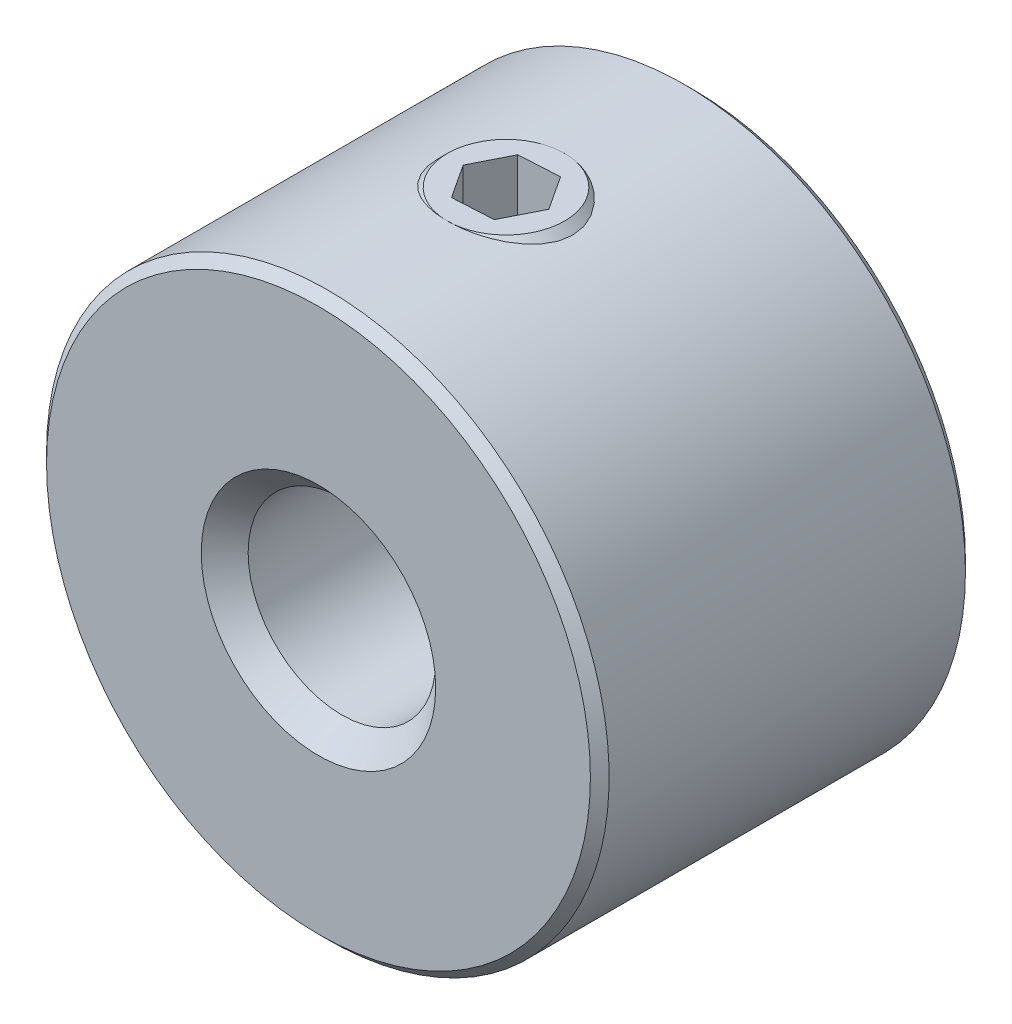
ISO-10303-21;
HEADER;
FILE_DESCRIPTION(('STEP AP214'),'2;1');
FILE_NAME('part.step','',(''),(''),'','','');
FILE_SCHEMA(('AUTOMOTIVE_DESIGN { 1 0 10303 214 1 1 1 1 }'));
ENDSEC;
DATA;
#1=APPLICATION_CONTEXT('core data for automotive mechanical design processes');
#2=APPLICATION_PROTOCOL_DEFINITION('international standard','automotive_design',2000,#1);
#3=PRODUCT_CONTEXT('',#1,'mechanical');
#4=PRODUCT('Part','Part','',(#3));
#5=PRODUCT_RELATED_PRODUCT_CATEGORY('part','',(#4));
#6=PRODUCT_DEFINITION_FORMATION('','',#4);
#7=PRODUCT_DEFINITION_CONTEXT('part definition',#1,'design');
#8=PRODUCT_DEFINITION('design','',#6,#7);
#9=PRODUCT_DEFINITION_SHAPE('','',#8);
#10=(LENGTH_UNIT() NAMED_UNIT(*) SI_UNIT(.MILLI.,.METRE.));
#11=(NAMED_UNIT(*) PLANE_ANGLE_UNIT() SI_UNIT($,.RADIAN.));
#12=(NAMED_UNIT(*) SI_UNIT($,.STERADIAN.) SOLID_ANGLE_UNIT());
#13=UNCERTAINTY_MEASURE_WITH_UNIT(LENGTH_MEASURE(1.E-05),#10,'distance_accuracy_value','');
#14=(GEOMETRIC_REPRESENTATION_CONTEXT(3) GLOBAL_UNCERTAINTY_ASSIGNED_CONTEXT((#13)) GLOBAL_UNIT_ASSIGNED_CONTEXT((#10,
#11,#12)) REPRESENTATION_CONTEXT('',''));
#15=CARTESIAN_POINT('',(0.,0.,0.));
#16=DIRECTION('',(0.,0.,1.));
#17=DIRECTION('',(1.,0.,0.));
#18=AXIS2_PLACEMENT_3D('',#15,#16,#17);
#19=CARTESIAN_POINT('',(0.,6.,4.00000000000001));
#20=DIRECTION('',(0.,-1.,0.));
#21=DIRECTION('',(0.,0.,-1.));
#22=AXIS2_PLACEMENT_3D('',#19,#20,#21);
#23=CYLINDRICAL_SURFACE('',#22,1.5);
#24=CARTESIAN_POINT('',(0.,5.75,4.00000000000001));
#25=DIRECTION('',(0.,1.,0.));
#26=DIRECTION('',(0.,0.,1.));
#27=AXIS2_PLACEMENT_3D('',#24,#25,#26);
#28=CIRCLE('',#27,1.5);
#29=CARTESIAN_POINT('',(0.,5.75,5.50000000000001));
#30=VERTEX_POINT('',#29);
#31=EDGE_CURVE('E12',#30,#30,#28,.F.);
#32=ORIENTED_EDGE('',*,*,#31,.T.);
#33=EDGE_LOOP('',(#32));
#34=FACE_BOUND('',#33,.T.);
#35=CARTESIAN_POINT('',(0.,1.5,4.00000000000001));
#36=DIRECTION('',(0.,1.,0.));
#37=DIRECTION('',(0.,0.,1.));
#38=AXIS2_PLACEMENT_3D('',#35,#36,#37);
#39=CIRCLE('',#38,1.5);
#40=CARTESIAN_POINT('',(0.,1.5,5.50000000000001));
#41=VERTEX_POINT('',#40);
#42=EDGE_CURVE('E146',#41,#41,#39,.T.);
#43=ORIENTED_EDGE('',*,*,#42,.T.);
#44=EDGE_LOOP('',(#43));
#45=FACE_BOUND('',#44,.T.);
#46=ADVANCED_FACE('F44',(#34,#45),#23,.T.);
#47=CARTESIAN_POINT('',(0.,6.,4.00000000000001));
#48=DIRECTION('',(0.,1.,0.));
#49=DIRECTION('',(0.,0.,1.));
#50=AXIS2_PLACEMENT_3D('',#47,#48,#49);
#51=PLANE('',#50);
#52=DIRECTION('',(0.998413648366382,0.,-0.0563044115121643));
#53=VECTOR('',#52,1.);
#54=CARTESIAN_POINT('',(-0.390097482851071,6.,4.77319076163213));
#55=LINE('',#54,#53);
#56=CARTESIAN_POINT('',(-0.390097482851071,6.,4.77319076163213));
#57=VERTEX_POINT('',#56);
#58=CARTESIAN_POINT('',(0.47455410011932,6.,4.72442971091746));
#59=VERTEX_POINT('',#58);
#60=EDGE_CURVE('E59',#57,#59,#55,.T.);
#61=ORIENTED_EDGE('',*,*,#60,.F.);
#62=DIRECTION('',(0.547967874897857,0.,0.836499377214309));
#63=VECTOR('',#62,1.);
#64=CARTESIAN_POINT('',(-0.864651582970388,6.,4.04876105071467));
#65=LINE('',#64,#63);
#66=CARTESIAN_POINT('',(-0.864651582970388,6.,4.04876105071467));
#67=VERTEX_POINT('',#66);
#68=EDGE_CURVE('E142',#67,#57,#65,.T.);
#69=ORIENTED_EDGE('',*,*,#68,.F.);
#70=DIRECTION('',(-0.450445773468524,0.,0.892803788726472));
#71=VECTOR('',#70,1.);
#72=CARTESIAN_POINT('',(-0.474554100119317,6.,3.27557028908255));
#73=LINE('',#72,#71);
#74=CARTESIAN_POINT('',(-0.474554100119317,6.,3.27557028908255));
#75=VERTEX_POINT('',#74);
#76=EDGE_CURVE('E140',#75,#67,#73,.T.);
#77=ORIENTED_EDGE('',*,*,#76,.F.);
#78=DIRECTION('',(-0.998413648366382,0.,0.0563044115121643));
#79=VECTOR('',#78,1.);
#80=CARTESIAN_POINT('',(0.390097482851073,6.,3.22680923836789));
#81=LINE('',#80,#79);
#82=CARTESIAN_POINT('',(0.390097482851073,6.,3.22680923836789));
#83=VERTEX_POINT('',#82);
#84=EDGE_CURVE('E107',#83,#75,#81,.T.);
#85=ORIENTED_EDGE('',*,*,#84,.F.);
#86=DIRECTION('',(-0.547967874897857,0.,-0.836499377214308));
#87=VECTOR('',#86,1.);
#88=CARTESIAN_POINT('',(0.864651582970391,6.,3.95123894928534));
#89=LINE('',#88,#87);
#90=CARTESIAN_POINT('',(0.864651582970391,6.,3.95123894928534));
#91=VERTEX_POINT('',#90);
#92=EDGE_CURVE('E136',#91,#83,#89,.T.);
#93=ORIENTED_EDGE('',*,*,#92,.F.);
#94=DIRECTION('',(0.450445773468524,0.,-0.892803788726472));
#95=VECTOR('',#94,1.);
#96=CARTESIAN_POINT('',(0.474554100119319,6.,4.72442971091746));
#97=LINE('',#96,#95);
#98=EDGE_CURVE('E133',#59,#91,#97,.T.);
#99=ORIENTED_EDGE('',*,*,#98,.F.);
#100=EDGE_LOOP('',(#61,#69,#77,#85,#93,#99));
#101=FACE_BOUND('',#100,.T.);
#102=CARTESIAN_POINT('',(0.,6.,4.00000000000001));
#103=DIRECTION('',(0.,1.,0.));
#104=DIRECTION('',(0.,0.,1.));
#105=AXIS2_PLACEMENT_3D('',#102,#103,#104);
#106=CIRCLE('',#105,1.25);
#107=CARTESIAN_POINT('',(0.,6.,5.25000000000001));
#108=VERTEX_POINT('',#107);
#109=EDGE_CURVE('E52',#108,#108,#106,.T.);
#110=ORIENTED_EDGE('',*,*,#109,.T.);
#111=EDGE_LOOP('',(#110));
#112=FACE_BOUND('',#111,.T.);
#113=ADVANCED_FACE('F156',(#101,#112),#51,.T.);
#114=CARTESIAN_POINT('',(0.,1.5,4.00000000000001));
#115=DIRECTION('',(0.,1.,0.));
#116=DIRECTION('',(0.,0.,1.));
#117=AXIS2_PLACEMENT_3D('',#114,#115,#116);
#118=PLANE('',#117);
#119=ORIENTED_EDGE('',*,*,#42,.F.);
#120=EDGE_LOOP('',(#119));
#121=FACE_BOUND('',#120,.T.);
#122=ADVANCED_FACE('F160',(#121),#118,.F.);
#123=CARTESIAN_POINT('',(0.,6.,4.00000000000001));
#124=DIRECTION('',(0.,-1.,0.));
#125=DIRECTION('',(0.,0.,-1.));
#126=AXIS2_PLACEMENT_3D('',#123,#124,#125);
#127=CONICAL_SURFACE('',#126,1.25,0.785398163397446);
#128=ORIENTED_EDGE('',*,*,#31,.F.);
#129=EDGE_LOOP('',(#128));
#130=FACE_BOUND('',#129,.T.);
#131=ORIENTED_EDGE('',*,*,#109,.F.);
#132=EDGE_LOOP('',(#131));
#133=FACE_BOUND('',#132,.T.);
#134=ADVANCED_FACE('F46',(#130,#133),#127,.T.);
#135=CARTESIAN_POINT('',(-0.390097482851071,4.,4.77319076163213));
#136=DIRECTION('',(0.0563044115121643,0.,0.998413648366382));
#137=DIRECTION('',(0.998413648366382,0.,-0.0563044115121643));
#138=AXIS2_PLACEMENT_3D('',#135,#136,#137);
#139=PLANE('',#138);
#140=ORIENTED_EDGE('',*,*,#60,.T.);
#141=DIRECTION('',(0.,1.,0.));
#142=VECTOR('',#141,1.);
#143=CARTESIAN_POINT('',(0.474554100119319,4.,4.72442971091746));
#144=LINE('',#143,#142);
#145=CARTESIAN_POINT('',(0.474554100119319,4.,4.72442971091746));
#146=VERTEX_POINT('',#145);
#147=EDGE_CURVE('E89',#146,#59,#144,.T.);
#148=ORIENTED_EDGE('',*,*,#147,.F.);
#149=DIRECTION('',(0.998413648366382,0.,-0.0563044115121643));
#150=VECTOR('',#149,1.);
#151=CARTESIAN_POINT('',(-0.390097482851071,4.,4.77319076163213));
#152=LINE('',#151,#150);
#153=CARTESIAN_POINT('',(-0.390097482851071,4.,4.77319076163213));
#154=VERTEX_POINT('',#153);
#155=EDGE_CURVE('E144',#154,#146,#152,.T.);
#156=ORIENTED_EDGE('',*,*,#155,.F.);
#157=DIRECTION('',(0.,1.,0.));
#158=VECTOR('',#157,1.);
#159=CARTESIAN_POINT('',(-0.390097482851071,4.,4.77319076163213));
#160=LINE('',#159,#158);
#161=EDGE_CURVE('E67',#154,#57,#160,.T.);
#162=ORIENTED_EDGE('',*,*,#161,.T.);
#163=EDGE_LOOP('',(#140,#148,#156,#162));
#164=FACE_BOUND('',#163,.T.);
#165=ADVANCED_FACE('F159',(#164),#139,.F.);
#166=CARTESIAN_POINT('',(-0.864651582970388,4.,4.04876105071467));
#167=DIRECTION('',(-0.836499377214309,0.,0.547967874897857));
#168=DIRECTION('',(0.547967874897857,0.,0.836499377214309));
#169=AXIS2_PLACEMENT_3D('',#166,#167,#168);
#170=PLANE('',#169);
#171=ORIENTED_EDGE('',*,*,#68,.T.);
#172=ORIENTED_EDGE('',*,*,#161,.F.);
#173=DIRECTION('',(0.547967874897857,0.,0.836499377214309));
#174=VECTOR('',#173,1.);
#175=CARTESIAN_POINT('',(-0.864651582970388,4.,4.04876105071467));
#176=LINE('',#175,#174);
#177=CARTESIAN_POINT('',(-0.864651582970388,4.,4.04876105071467));
#178=VERTEX_POINT('',#177);
#179=EDGE_CURVE('E119',#178,#154,#176,.T.);
#180=ORIENTED_EDGE('',*,*,#179,.F.);
#181=DIRECTION('',(0.,1.,0.));
#182=VECTOR('',#181,1.);
#183=CARTESIAN_POINT('',(-0.864651582970388,4.,4.04876105071467));
#184=LINE('',#183,#182);
#185=EDGE_CURVE('E111',#178,#67,#184,.T.);
#186=ORIENTED_EDGE('',*,*,#185,.T.);
#187=EDGE_LOOP('',(#171,#172,#180,#186));
#188=FACE_BOUND('',#187,.T.);
#189=ADVANCED_FACE('F166',(#188),#170,.F.);
#190=CARTESIAN_POINT('',(-0.474554100119317,4.,3.27557028908255));
#191=DIRECTION('',(-0.892803788726472,0.,-0.450445773468524));
#192=DIRECTION('',(-0.450445773468524,0.,0.892803788726472));
#193=AXIS2_PLACEMENT_3D('',#190,#191,#192);
#194=PLANE('',#193);
#195=ORIENTED_EDGE('',*,*,#76,.T.);
#196=ORIENTED_EDGE('',*,*,#185,.F.);
#197=DIRECTION('',(-0.450445773468524,0.,0.892803788726472));
#198=VECTOR('',#197,1.);
#199=CARTESIAN_POINT('',(-0.474554100119317,4.,3.27557028908255));
#200=LINE('',#199,#198);
#201=CARTESIAN_POINT('',(-0.474554100119317,4.,3.27557028908255));
#202=VERTEX_POINT('',#201);
#203=EDGE_CURVE('E115',#202,#178,#200,.T.);
#204=ORIENTED_EDGE('',*,*,#203,.F.);
#205=DIRECTION('',(0.,1.,0.));
#206=VECTOR('',#205,1.);
#207=CARTESIAN_POINT('',(-0.474554100119317,4.,3.27557028908255));
#208=LINE('',#207,#206);
#209=EDGE_CURVE('E100',#202,#75,#208,.T.);
#210=ORIENTED_EDGE('',*,*,#209,.T.);
#211=EDGE_LOOP('',(#195,#196,#204,#210));
#212=FACE_BOUND('',#211,.T.);
#213=ADVANCED_FACE('F116',(#212),#194,.F.);
#214=CARTESIAN_POINT('',(0.390097482851073,4.,3.22680923836789));
#215=DIRECTION('',(-0.0563044115121643,0.,-0.998413648366382));
#216=DIRECTION('',(-0.998413648366382,0.,0.0563044115121643));
#217=AXIS2_PLACEMENT_3D('',#214,#215,#216);
#218=PLANE('',#217);
#219=ORIENTED_EDGE('',*,*,#84,.T.);
#220=ORIENTED_EDGE('',*,*,#209,.F.);
#221=DIRECTION('',(-0.998413648366382,0.,0.0563044115121643));
#222=VECTOR('',#221,1.);
#223=CARTESIAN_POINT('',(0.390097482851073,4.,3.22680923836789));
#224=LINE('',#223,#222);
#225=CARTESIAN_POINT('',(0.390097482851073,4.,3.22680923836789));
#226=VERTEX_POINT('',#225);
#227=EDGE_CURVE('E104',#226,#202,#224,.T.);
#228=ORIENTED_EDGE('',*,*,#227,.F.);
#229=DIRECTION('',(0.,1.,0.));
#230=VECTOR('',#229,1.);
#231=CARTESIAN_POINT('',(0.390097482851073,4.,3.22680923836789));
#232=LINE('',#231,#230);
#233=EDGE_CURVE('E112',#226,#83,#232,.T.);
#234=ORIENTED_EDGE('',*,*,#233,.T.);
#235=EDGE_LOOP('',(#219,#220,#228,#234));
#236=FACE_BOUND('',#235,.T.);
#237=ADVANCED_FACE('F102',(#236),#218,.F.);
#238=CARTESIAN_POINT('',(0.864651582970391,4.,3.95123894928534));
#239=DIRECTION('',(0.836499377214308,0.,-0.547967874897857));
#240=DIRECTION('',(-0.547967874897857,0.,-0.836499377214309));
#241=AXIS2_PLACEMENT_3D('',#238,#239,#240);
#242=PLANE('',#241);
#243=ORIENTED_EDGE('',*,*,#92,.T.);
#244=ORIENTED_EDGE('',*,*,#233,.F.);
#245=DIRECTION('',(-0.547967874897857,0.,-0.836499377214308));
#246=VECTOR('',#245,1.);
#247=CARTESIAN_POINT('',(0.864651582970391,4.,3.95123894928534));
#248=LINE('',#247,#246);
#249=CARTESIAN_POINT('',(0.864651582970391,4.,3.95123894928534));
#250=VERTEX_POINT('',#249);
#251=EDGE_CURVE('E125',#250,#226,#248,.T.);
#252=ORIENTED_EDGE('',*,*,#251,.F.);
#253=DIRECTION('',(0.,1.,0.));
#254=VECTOR('',#253,1.);
#255=CARTESIAN_POINT('',(0.864651582970391,4.,3.95123894928534));
#256=LINE('',#255,#254);
#257=EDGE_CURVE('E149',#250,#91,#256,.T.);
#258=ORIENTED_EDGE('',*,*,#257,.T.);
#259=EDGE_LOOP('',(#243,#244,#252,#258));
#260=FACE_BOUND('',#259,.T.);
#261=ADVANCED_FACE('F183',(#260),#242,.F.);
#262=CARTESIAN_POINT('',(0.474554100119319,4.,4.72442971091746));
#263=DIRECTION('',(0.892803788726472,0.,0.450445773468524));
#264=DIRECTION('',(0.450445773468524,0.,-0.892803788726472));
#265=AXIS2_PLACEMENT_3D('',#262,#263,#264);
#266=PLANE('',#265);
#267=ORIENTED_EDGE('',*,*,#98,.T.);
#268=ORIENTED_EDGE('',*,*,#257,.F.);
#269=DIRECTION('',(0.450445773468524,0.,-0.892803788726472));
#270=VECTOR('',#269,1.);
#271=CARTESIAN_POINT('',(0.474554100119319,4.,4.72442971091746));
#272=LINE('',#271,#270);
#273=EDGE_CURVE('E127',#146,#250,#272,.T.);
#274=ORIENTED_EDGE('',*,*,#273,.F.);
#275=ORIENTED_EDGE('',*,*,#147,.T.);
#276=EDGE_LOOP('',(#267,#268,#274,#275));
#277=FACE_BOUND('',#276,.T.);
#278=ADVANCED_FACE('F180',(#277),#266,.F.);
#279=CARTESIAN_POINT('',(0.,4.,0.));
#280=DIRECTION('',(0.,1.,0.));
#281=DIRECTION('',(0.,0.,1.));
#282=AXIS2_PLACEMENT_3D('',#279,#280,#281);
#283=PLANE('',#282);
#284=ORIENTED_EDGE('',*,*,#155,.T.);
#285=ORIENTED_EDGE('',*,*,#273,.T.);
#286=ORIENTED_EDGE('',*,*,#251,.T.);
#287=ORIENTED_EDGE('',*,*,#227,.T.);
#288=ORIENTED_EDGE('',*,*,#203,.T.);
#289=ORIENTED_EDGE('',*,*,#179,.T.);
#290=EDGE_LOOP('',(#284,#285,#286,#287,#288,#289));
#291=FACE_BOUND('',#290,.T.);
#292=ADVANCED_FACE('F122',(#291),#283,.T.);
#293=CLOSED_SHELL('',(#46,#113,#122,#134,#165,#189,#213,#237,#261,#278,#292));
#294=MANIFOLD_SOLID_BREP('B2',#293);
#295=CARTESIAN_POINT('',(0.,0.,-122.457916377033));
#296=DIRECTION('',(0.,0.,-1.));
#297=DIRECTION('',(-1.,0.,0.));
#298=AXIS2_PLACEMENT_3D('',#295,#296,#297);
#299=CYLINDRICAL_SURFACE('',#298,2.00000000000002);
#300=CARTESIAN_POINT('',(0.,0.,0.499999999999987));
#301=DIRECTION('',(0.,0.,1.));
#302=DIRECTION('',(1.,0.,0.));
#303=AXIS2_PLACEMENT_3D('',#300,#301,#302);
#304=CIRCLE('',#303,2.00000000000002);
#305=CARTESIAN_POINT('',(2.00000000000002,0.,0.499999999999987));
#306=VERTEX_POINT('',#305);
#307=EDGE_CURVE('E275',#306,#306,#304,.F.);
#308=ORIENTED_EDGE('',*,*,#307,.T.);
#309=EDGE_LOOP('',(#308));
#310=FACE_BOUND('',#309,.T.);
#311=CARTESIAN_POINT('',(0.,0.,7.50000000000001));
#312=DIRECTION('',(0.,0.,-1.));
#313=DIRECTION('',(-1.,0.,0.));
#314=AXIS2_PLACEMENT_3D('',#311,#312,#313);
#315=CIRCLE('',#314,2.00000000000002);
#316=CARTESIAN_POINT('',(-2.00000000000002,0.,7.50000000000001));
#317=VERTEX_POINT('',#316);
#318=EDGE_CURVE('E279',#317,#317,#315,.F.);
#319=ORIENTED_EDGE('',*,*,#318,.T.);
#320=EDGE_LOOP('',(#319));
#321=FACE_BOUND('',#320,.T.);
#322=CARTESIAN_POINT('',(0.,2.00000000000002,2.75000000000001));
#323=CARTESIAN_POINT('',(0.0635104730002037,1.99999595305314,2.75000434999879));
#324=CARTESIAN_POINT('',(0.127096441053759,1.99694323311002,2.75487301181782));
#325=CARTESIAN_POINT('',(0.252318262265284,1.98502167724104,2.77408580342951));
#326=CARTESIAN_POINT('',(0.313950163299075,1.97614175574897,2.78844799392549));
#327=CARTESIAN_POINT('',(0.433205558136785,1.95345852982136,2.82581136316206));
#328=CARTESIAN_POINT('',(0.490847243665019,1.93967960778664,2.84876978784089));
#329=CARTESIAN_POINT('',(0.601260368868363,1.90834598486075,2.90238585079676));
#330=CARTESIAN_POINT('',(0.654032347276155,1.89079170235273,2.9330426360092));
#331=CARTESIAN_POINT('',(0.757974192167976,1.85170152902275,3.00388657318498));
#332=CARTESIAN_POINT('',(0.80867956076998,1.82995962224618,3.04463929997546));
#333=CARTESIAN_POINT('',(0.902986375146762,1.78531349913633,3.13321917450656));
#334=CARTESIAN_POINT('',(0.946578107215737,1.76240774858554,3.18105582825794));
#335=CARTESIAN_POINT('',(1.03142873237133,1.714304186552,3.29003389420452));
#336=CARTESIAN_POINT('',(1.07157206029151,1.68921610993414,3.35209978660728));
#337=CARTESIAN_POINT('',(1.1407396602004,1.64330198128733,3.48356481544719));
#338=CARTESIAN_POINT('',(1.16978270899535,1.6224687599624,3.55295131257609));
#339=CARTESIAN_POINT('',(1.20933400585981,1.59309575627366,3.67881052377873));
#340=CARTESIAN_POINT('',(1.22269552371394,1.58276905990075,3.73396681853883));
#341=CARTESIAN_POINT('',(1.2418184358548,1.56781357325807,3.84630592561081));
#342=CARTESIAN_POINT('',(1.24759056342088,1.56317673673694,3.9034857582745));
#343=CARTESIAN_POINT('',(1.2511891824572,1.56029885782829,4.01841301675113));
#344=CARTESIAN_POINT('',(1.24899483727851,1.5620745877172,4.07616153646241));
#345=CARTESIAN_POINT('',(1.23676317046804,1.57177402383922,4.19031010318897));
#346=CARTESIAN_POINT('',(1.22671956265044,1.57970265767112,4.24670903203909));
#347=CARTESIAN_POINT('',(1.19968103371474,1.60032573121783,4.35543845265749));
#348=CARTESIAN_POINT('',(1.18285016736897,1.61290715104816,4.40783245568428));
#349=CARTESIAN_POINT('',(1.14290189820937,1.64145566443408,4.50916118240543));
#350=CARTESIAN_POINT('',(1.11978227193696,1.65742395501355,4.55809467487451));
#351=CARTESIAN_POINT('',(1.06294892954949,1.69454815993022,4.66083327383275));
#352=CARTESIAN_POINT('',(1.0280629660117,1.71611591575961,4.7138408101204));
#353=CARTESIAN_POINT('',(0.950881463002099,1.76005711791245,4.81383027900049));
#354=CARTESIAN_POINT('',(0.908578308011434,1.78243137335977,4.86080593170653));
#355=CARTESIAN_POINT('',(0.809519713023327,1.82979894916859,4.95530174937041));
#356=CARTESIAN_POINT('',(0.751531353595328,1.85461531676595,5.00163297425885));
#357=CARTESIAN_POINT('',(0.627148099593564,1.90028055062447,5.08385089588726));
#358=CARTESIAN_POINT('',(0.560756523881993,1.92113097514766,5.11974169772894));
#359=CARTESIAN_POINT('',(0.424883562934742,1.95553372961318,5.17776368838143));
#360=CARTESIAN_POINT('',(0.355763457732365,1.96941976591576,5.2005340399812));
#361=CARTESIAN_POINT('',(0.21361215457497,1.9898492931005,5.23376492798282));
#362=CARTESIAN_POINT('',(0.140586648341299,1.99640317990071,5.24424289422201));
#363=CARTESIAN_POINT('',(0.00451561874058265,2.00097840540093,5.25156585006121));
#364=CARTESIAN_POINT('',(-0.0584027741637907,2.00012161345512,5.25020317795386));
#365=CARTESIAN_POINT('',(-0.182972117996315,1.99258901494328,5.23811717157928));
#366=CARTESIAN_POINT('',(-0.244623154962739,1.98591360473593,5.22739447490784));
#367=CARTESIAN_POINT('',(-0.362521070658195,1.96774052283071,5.19776146330805));
#368=CARTESIAN_POINT('',(-0.41888500995321,1.95644170526845,5.17918784320336));
#369=CARTESIAN_POINT('',(-0.527638281070994,1.92995684104753,5.13470361072144));
#370=CARTESIAN_POINT('',(-0.580026945470721,1.91477014350268,5.10879176974485));
#371=CARTESIAN_POINT('',(-0.685084056277263,1.87990012356002,5.04748479400452));
#372=CARTESIAN_POINT('',(-0.73724696784341,1.85991764817226,5.01139643076177));
#373=CARTESIAN_POINT('',(-0.835142640217346,1.81806970001718,4.93220613484719));
#374=CARTESIAN_POINT('',(-0.88086815129186,1.79620214826385,4.88909641074546));
#375=CARTESIAN_POINT('',(-0.971474198022889,1.74905869713093,4.78986496058735));
#376=CARTESIAN_POINT('',(-1.01526851939753,1.72374883414959,4.73276279370522));
#377=CARTESIAN_POINT('',(-1.09280351885684,1.67566762748174,4.61112421505574));
#378=CARTESIAN_POINT('',(-1.12655115718694,1.65289453322338,4.54659299324701));
#379=CARTESIAN_POINT('',(-1.17684772011828,1.61733530314594,4.42530785194312));
#380=CARTESIAN_POINT('',(-1.1955189586548,1.60345636193781,4.36975924926778));
#381=CARTESIAN_POINT('',(-1.22500108205245,1.58105030663769,4.25560685423108));
#382=CARTESIAN_POINT('',(-1.23582424983127,1.57251483242607,4.19700799054854));
#383=CARTESIAN_POINT('',(-1.24901383653654,1.56206324988733,4.07790972311931));
#384=CARTESIAN_POINT('',(-1.25133186963292,1.56018501674571,4.01740141451182));
#385=CARTESIAN_POINT('',(-1.24719778716817,1.56349063109849,3.89686903963396));
#386=CARTESIAN_POINT('',(-1.24074275650142,1.56867682595588,3.83684514099048));
#387=CARTESIAN_POINT('',(-1.22038272403399,1.58455388771336,3.72397020494864));
#388=CARTESIAN_POINT('',(-1.2071191949977,1.59476808051062,3.67093069858359));
#389=CARTESIAN_POINT('',(-1.17417623469513,1.61917530435692,3.56786494041409));
#390=CARTESIAN_POINT('',(-1.15449412799406,1.6333699942373,3.51783995546249));
#391=CARTESIAN_POINT('',(-1.10602690439617,1.6666390288652,3.4144032561273));
#392=CARTESIAN_POINT('',(-1.0763364445546,1.68612230498999,3.36154970152344));
#393=CARTESIAN_POINT('',(-1.01000017036389,1.7266770641187,3.26106163275399));
#394=CARTESIAN_POINT('',(-0.973348732866935,1.74774982276827,3.21343138743952));
#395=CARTESIAN_POINT('',(-0.885670221416053,1.79401910731184,3.11498574502216));
#396=CARTESIAN_POINT('',(-0.833233674246787,1.81920541808778,3.06540915455452));
#397=CARTESIAN_POINT('',(-0.719822446025195,1.8669872905675,2.97550517029476));
#398=CARTESIAN_POINT('',(-0.65884251513854,1.88958124364397,2.9351835040726));
#399=CARTESIAN_POINT('',(-0.529355399891397,1.9298671097655,2.8652288698759));
#400=CARTESIAN_POINT('',(-0.46083572705656,1.94755071355358,2.83561399459416));
#401=CARTESIAN_POINT('',(-0.318394712729488,1.97581521637844,2.78892811566826));
#402=CARTESIAN_POINT('',(-0.244493501106839,1.98642121428691,2.77181276513022));
#403=CARTESIAN_POINT('',(-0.141418481224654,1.99519472168145,2.75770079083737));
#404=CARTESIAN_POINT('',(-0.113248608862862,1.99699172226303,2.75481813466603));
#405=CARTESIAN_POINT('',(-0.0567241864870854,1.99939530213241,2.7509667084624));
#406=CARTESIAN_POINT('',(-0.0283696251514501,2.00000180773912,2.74999805689001));
#407=CARTESIAN_POINT('',(0.,2.00000000000002,2.75000000000001));
#408=B_SPLINE_CURVE_WITH_KNOTS('',3,(#322,#323,#324,#325,#326,#327,#328,#329,#330,#331,#332,
#333,#334,#335,#336,#337,#338,#339,#340,#341,#342,#343,#344,#345,#346,#347,#348,#349,#350,#351,
#352,#353,#354,#355,#356,#357,#358,#359,#360,#361,#362,#363,#364,#365,#366,#367,#368,#369,#370,
#371,#372,#373,#374,#375,#376,#377,#378,#379,#380,#381,#382,#383,#384,#385,#386,#387,#388,#389,
#390,#391,#392,#393,#394,#395,#396,#397,#398,#399,#400,#401,#402,#403,#404,#405,#406,#407),
.UNSPECIFIED.,.T.,.F.,(4,2,2,2,2,2,2,2,2,2,2,2,2,2,2,2,2,2,2,2,2,2,2,2,2,2,2,2,2,2,2,2,2,2,2,2,
2,2,2,2,2,2,4),(0.,0.190412301434133,0.381187894128463,0.571026987595138,0.760845054038797,
0.96582187053622,1.17107628325702,1.40412975852974,1.63678724607011,1.80912008879717,
1.98120894707391,2.15374823498779,2.32642584505084,2.49515839460437,2.66395067908034,
2.86427450354361,3.06480522575183,3.29842180699523,3.53194640727862,3.7528417413596,
3.97342347958132,4.16127180597574,4.34910733732282,4.52959504531299,4.71011298928468,
4.90885230990554,5.10781368827687,5.33565708863715,5.56334227196912,5.74329940313721,
5.92297427413354,6.10366974688202,6.28442527563865,6.45063169037742,6.61690747313444,
6.8072552303698,6.99775741153771,7.22600539035114,7.45439424578502,7.68316725607079,
7.91112460944409,7.99617501232482,8.08123067890589),.UNSPECIFIED.);
#409=CARTESIAN_POINT('',(0.,2.00000000000002,2.75000000000001));
#410=VERTEX_POINT('',#409);
#411=EDGE_CURVE('E303',#410,#410,#408,.T.);
#412=ORIENTED_EDGE('',*,*,#411,.F.);
#413=EDGE_LOOP('',(#412));
#414=FACE_BOUND('',#413,.T.);
#415=ADVANCED_FACE('F264',(#310,#321,#414),#299,.F.);
#416=CARTESIAN_POINT('',(0.,0.,-122.457916377033));
#417=DIRECTION('',(0.,0.,-1.));
#418=DIRECTION('',(-1.,0.,0.));
#419=AXIS2_PLACEMENT_3D('',#416,#417,#418);
#420=CYLINDRICAL_SURFACE('',#419,6.00000000000002);
#421=CARTESIAN_POINT('',(0.,0.,0.200000000000006));
#422=DIRECTION('',(0.,0.,1.));
#423=DIRECTION('',(1.,0.,0.));
#424=AXIS2_PLACEMENT_3D('',#421,#422,#423);
#425=CIRCLE('',#424,6.00000000000002);
#426=CARTESIAN_POINT('',(6.00000000000002,0.,0.200000000000006));
#427=VERTEX_POINT('',#426);
#428=EDGE_CURVE('E287',#427,#427,#425,.T.);
#429=ORIENTED_EDGE('',*,*,#428,.T.);
#430=EDGE_LOOP('',(#429));
#431=FACE_BOUND('',#430,.T.);
#432=CARTESIAN_POINT('',(0.,0.,7.8));
#433=DIRECTION('',(0.,0.,-1.));
#434=DIRECTION('',(-1.,0.,0.));
#435=AXIS2_PLACEMENT_3D('',#432,#433,#434);
#436=CIRCLE('',#435,6.00000000000002);
#437=CARTESIAN_POINT('',(-6.00000000000002,0.,7.8));
#438=VERTEX_POINT('',#437);
#439=EDGE_CURVE('E290',#438,#438,#436,.T.);
#440=ORIENTED_EDGE('',*,*,#439,.T.);
#441=EDGE_LOOP('',(#440));
#442=FACE_BOUND('',#441,.T.);
#443=CARTESIAN_POINT('',(0.,6.00000000000002,2.75000000000001));
#444=CARTESIAN_POINT('',(-0.0694090417016598,5.99999871526653,2.75000247746923));
#445=CARTESIAN_POINT('',(-0.138848789520875,5.99878328775045,2.75580066571876));
#446=CARTESIAN_POINT('',(-0.275761316266993,5.99405200990681,2.77881934953286));
#447=CARTESIAN_POINT('',(-0.343232560128312,5.9905344118925,2.79604852303694));
#448=CARTESIAN_POINT('',(-0.474209132291342,5.98159109196203,2.84137045492182));
#449=CARTESIAN_POINT('',(-0.537718336709185,5.97616727052647,2.86945239599889));
#450=CARTESIAN_POINT('',(-0.659120328605958,5.9639992780986,2.93564960885619));
#451=CARTESIAN_POINT('',(-0.717013367534327,5.95725516625977,2.97376443115584));
#452=CARTESIAN_POINT('',(-0.826390324308837,5.94307700024652,3.05953634019065));
#453=CARTESIAN_POINT('',(-0.877780244162685,5.93563505848533,3.10731200123509));
#454=CARTESIAN_POINT('',(-0.971877776769393,5.9209565769245,3.21079465919512));
#455=CARTESIAN_POINT('',(-1.01458467096099,5.91372005416684,3.26650231187227));
#456=CARTESIAN_POINT('',(-1.09051031677217,5.9001944259531,3.38495196876616));
#457=CARTESIAN_POINT('',(-1.12363054680651,5.8939154517483,3.44775838450275));
#458=CARTESIAN_POINT('',(-1.17881119348064,5.88312840650022,3.57819745177276));
#459=CARTESIAN_POINT('',(-1.20087280167641,5.8786201446757,3.64582958244254));
#460=CARTESIAN_POINT('',(-1.23300240133737,5.87196500986124,3.78298523741564));
#461=CARTESIAN_POINT('',(-1.24323597696799,5.86978556855867,3.85246835933477));
#462=CARTESIAN_POINT('',(-1.25193357655615,5.86793690716492,3.99219684286264));
#463=CARTESIAN_POINT('',(-1.25039890894687,5.86826740800983,4.0624421188653));
#464=CARTESIAN_POINT('',(-1.23573719037197,5.87137174319176,4.20048102797518));
#465=CARTESIAN_POINT('',(-1.2228010523272,5.87410533679903,4.26829597966122));
#466=CARTESIAN_POINT('',(-1.18600543529945,5.88164437615944,4.40077150964493));
#467=CARTESIAN_POINT('',(-1.16214539481382,5.88644992841319,4.46543192560634));
#468=CARTESIAN_POINT('',(-1.10400003213928,5.89763191464104,4.59030722841599));
#469=CARTESIAN_POINT('',(-1.06964002534237,5.90401953785587,4.65048629652708));
#470=CARTESIAN_POINT('',(-0.991522699274818,5.91763890010723,4.76429574426817));
#471=CARTESIAN_POINT('',(-0.947764212262588,5.92487074398539,4.81792530883598));
#472=CARTESIAN_POINT('',(-0.851074921546783,5.9395373092991,4.91821396108038));
#473=CARTESIAN_POINT('',(-0.797981433412082,5.94697323199475,4.96471616889702));
#474=CARTESIAN_POINT('',(-0.684667288611797,5.96108088143003,5.04818044222898));
#475=CARTESIAN_POINT('',(-0.624446525025765,5.96775259670238,5.08514236459841));
#476=CARTESIAN_POINT('',(-0.498405541235478,5.97959870942817,5.14851008153596));
#477=CARTESIAN_POINT('',(-0.432575461926499,5.9847703971026,5.17489680456713));
#478=CARTESIAN_POINT('',(-0.297284620972154,5.99301338211283,5.2161917048355));
#479=CARTESIAN_POINT('',(-0.227824338595088,5.99608495596055,5.23110139323141));
#480=CARTESIAN_POINT('',(-0.0885918657008337,5.99974275215457,5.24879425206789));
#481=CARTESIAN_POINT('',(-0.018848055526177,6.00037293537581,5.25179194149426));
#482=CARTESIAN_POINT('',(0.120143798757716,5.99919952252775,5.24615505003091));
#483=CARTESIAN_POINT('',(0.18939187296226,5.99739607548155,5.23752118139841));
#484=CARTESIAN_POINT('',(0.324726367119815,5.99158564979186,5.20904434653048));
#485=CARTESIAN_POINT('',(0.390837192894208,5.98760052868079,5.18931251461654));
#486=CARTESIAN_POINT('',(0.518811446661334,5.97787227242396,5.1393221395786));
#487=CARTESIAN_POINT('',(0.580674536336777,5.9721289974458,5.10906275913403));
#488=CARTESIAN_POINT('',(0.699294306943496,5.95941241490716,5.03841962176245));
#489=CARTESIAN_POINT('',(0.755973219469837,5.95242393812332,4.99790807043095));
#490=CARTESIAN_POINT('',(0.861805445886523,5.93802568299711,4.90808043692374));
#491=CARTESIAN_POINT('',(0.910957877913288,5.93061585542513,4.85876332448107));
#492=CARTESIAN_POINT('',(1.0011786486518,5.91606024531379,4.75174442300031));
#493=CARTESIAN_POINT('',(1.04209914600205,5.90892089307503,4.69391696804473));
#494=CARTESIAN_POINT('',(1.11364719079244,5.89585601015807,4.57208371578622));
#495=CARTESIAN_POINT('',(1.14427516677864,5.88993042894653,4.5080781758609));
#496=CARTESIAN_POINT('',(1.19417246443922,5.88001700708043,4.37603880370178));
#497=CARTESIAN_POINT('',(1.21350309828032,5.87601872784689,4.30802896283417));
#498=CARTESIAN_POINT('',(1.24044038523408,5.87039184709699,4.16963344950775));
#499=CARTESIAN_POINT('',(1.24804871544441,5.86876290660369,4.09924811838057));
#500=CARTESIAN_POINT('',(1.25125926487612,5.86807907308508,3.95958659900036));
#501=CARTESIAN_POINT('',(1.24709542622726,5.86897402321503,3.89031592977795));
#502=CARTESIAN_POINT('',(1.22739905314032,5.87312447254929,3.75348599107979));
#503=CARTESIAN_POINT('',(1.21186662782266,5.87637994909628,3.6859267051839));
#504=CARTESIAN_POINT('',(1.16998217768585,5.88486132447717,3.55460222810935));
#505=CARTESIAN_POINT('',(1.14366117568421,5.89008157007932,3.49082675351308));
#506=CARTESIAN_POINT('',(1.08097457299757,5.90190705738739,3.36856122397334));
#507=CARTESIAN_POINT('',(1.0446080398303,5.90851242765462,3.31007166036688));
#508=CARTESIAN_POINT('',(0.962073695342412,5.92251579551148,3.19887837292056));
#509=CARTESIAN_POINT('',(0.915737890418227,5.92992613868406,3.14630087543502));
#510=CARTESIAN_POINT('',(0.814924438115336,5.94461839583214,3.04959050677365));
#511=CARTESIAN_POINT('',(0.760444918832969,5.95190027984881,3.00545958244852));
#512=CARTESIAN_POINT('',(0.644134427507704,5.96561444547639,2.92641142681595));
#513=CARTESIAN_POINT('',(0.582225921521349,5.97203596073246,2.89160632011372));
#514=CARTESIAN_POINT('',(0.453319843998455,5.98319908494094,2.83294977156998));
#515=CARTESIAN_POINT('',(0.386326781907245,5.98794216182102,2.80908875281813));
#516=CARTESIAN_POINT('',(0.266015292900106,5.99432499781445,2.77745972171158));
#517=CARTESIAN_POINT('',(0.21336759372793,5.99644035661397,2.76718123679115));
#518=CARTESIAN_POINT('',(0.107152674176538,5.9992783278976,2.75345054572267));
#519=CARTESIAN_POINT('',(0.0535854878488726,6.00000099184588,2.74999808733281));
#520=CARTESIAN_POINT('',(0.,6.00000000000002,2.75000000000001));
#521=B_SPLINE_CURVE_WITH_KNOTS('',3,(#443,#444,#445,#446,#447,#448,#449,#450,#451,#452,#453,
#454,#455,#456,#457,#458,#459,#460,#461,#462,#463,#464,#465,#466,#467,#468,#469,#470,#471,#472,
#473,#474,#475,#476,#477,#478,#479,#480,#481,#482,#483,#484,#485,#486,#487,#488,#489,#490,#491,
#492,#493,#494,#495,#496,#497,#498,#499,#500,#501,#502,#503,#504,#505,#506,#507,#508,#509,#510,
#511,#512,#513,#514,#515,#516,#517,#518,#519,#520),.UNSPECIFIED.,.T.,.F.,(4,2,2,2,2,2,2,2,2,2,2,
2,2,2,2,2,2,2,2,2,2,2,2,2,2,2,2,2,2,2,2,2,2,2,2,2,2,2,4),(0.,0.208031045103184,
0.416220199906225,0.624202378825444,0.832175241572991,1.04287526388123,1.25359271551786,
1.46640449178549,1.6791933328549,1.88896575169855,2.09871484767165,2.3050171212906,
2.5113300003028,2.7191459241675,2.92698768368035,3.13889526355466,3.35080602278218,
3.56309724499663,3.77536051045772,3.98378339407676,4.19219351552278,4.39855286632622,
4.60492863390934,4.81401583995737,5.02312752564575,5.23571263829337,5.4482888985131,
5.65970050095026,5.87108185414185,6.07829223291039,6.28550062281362,6.49211731393256,
6.69875319081481,6.9091902483031,7.1196757511737,7.33258864398257,7.54531486464974,
7.70592588477281,7.86653096973392),.UNSPECIFIED.);
#522=CARTESIAN_POINT('',(0.,6.00000000000002,2.75000000000001));
#523=VERTEX_POINT('',#522);
#524=EDGE_CURVE('E296',#523,#523,#521,.T.);
#525=ORIENTED_EDGE('',*,*,#524,.F.);
#526=EDGE_LOOP('',(#525));
#527=FACE_BOUND('',#526,.T.);
#528=ADVANCED_FACE('F307',(#431,#442,#527),#420,.T.);
#529=CARTESIAN_POINT('',(6.00000000000002,0.,0.));
#530=DIRECTION('',(0.,0.,1.));
#531=DIRECTION('',(1.,0.,0.));
#532=AXIS2_PLACEMENT_3D('',#529,#530,#531);
#533=PLANE('',#532);
#534=CARTESIAN_POINT('',(0.,0.,0.));
#535=DIRECTION('',(0.,0.,1.));
#536=DIRECTION('',(1.,0.,0.));
#537=AXIS2_PLACEMENT_3D('',#534,#535,#536);
#538=CIRCLE('',#537,2.50000000000001);
#539=CARTESIAN_POINT('',(2.50000000000001,0.,0.));
#540=VERTEX_POINT('',#539);
#541=EDGE_CURVE('E271',#540,#540,#538,.T.);
#542=ORIENTED_EDGE('',*,*,#541,.T.);
#543=EDGE_LOOP('',(#542));
#544=FACE_BOUND('',#543,.T.);
#545=CARTESIAN_POINT('',(0.,0.,0.));
#546=DIRECTION('',(0.,0.,1.));
#547=DIRECTION('',(1.,0.,0.));
#548=AXIS2_PLACEMENT_3D('',#545,#546,#547);
#549=CIRCLE('',#548,5.80000000000001);
#550=CARTESIAN_POINT('',(5.80000000000001,0.,0.));
#551=VERTEX_POINT('',#550);
#552=EDGE_CURVE('E293',#551,#551,#549,.F.);
#553=ORIENTED_EDGE('',*,*,#552,.T.);
#554=EDGE_LOOP('',(#553));
#555=FACE_BOUND('',#554,.T.);
#556=ADVANCED_FACE('F324',(#544,#555),#533,.F.);
#557=CARTESIAN_POINT('',(2.00000000000002,0.,8.));
#558=DIRECTION('',(0.,0.,-1.));
#559=DIRECTION('',(-1.,0.,0.));
#560=AXIS2_PLACEMENT_3D('',#557,#558,#559);
#561=PLANE('',#560);
#562=CARTESIAN_POINT('',(0.,0.,8.));
#563=DIRECTION('',(0.,0.,-1.));
#564=DIRECTION('',(-1.,0.,0.));
#565=AXIS2_PLACEMENT_3D('',#562,#563,#564);
#566=CIRCLE('',#565,2.50000000000001);
#567=CARTESIAN_POINT('',(-2.50000000000001,0.,8.));
#568=VERTEX_POINT('',#567);
#569=EDGE_CURVE('E43',#568,#568,#566,.T.);
#570=ORIENTED_EDGE('',*,*,#569,.T.);
#571=EDGE_LOOP('',(#570));
#572=FACE_BOUND('',#571,.T.);
#573=CARTESIAN_POINT('',(0.,0.,8.));
#574=DIRECTION('',(0.,0.,-1.));
#575=DIRECTION('',(-1.,0.,0.));
#576=AXIS2_PLACEMENT_3D('',#573,#574,#575);
#577=CIRCLE('',#576,5.80000000000004);
#578=CARTESIAN_POINT('',(-5.80000000000004,0.,8.));
#579=VERTEX_POINT('',#578);
#580=EDGE_CURVE('E284',#579,#579,#577,.F.);
#581=ORIENTED_EDGE('',*,*,#580,.T.);
#582=EDGE_LOOP('',(#581));
#583=FACE_BOUND('',#582,.T.);
#584=ADVANCED_FACE('F314',(#572,#583),#561,.F.);
#585=CARTESIAN_POINT('',(0.,6.00000000000002,4.00000000000001));
#586=DIRECTION('',(0.,-1.,0.));
#587=DIRECTION('',(0.,0.,-1.));
#588=AXIS2_PLACEMENT_3D('',#585,#586,#587);
#589=CYLINDRICAL_SURFACE('',#588,1.25);
#590=ORIENTED_EDGE('',*,*,#524,.T.);
#591=EDGE_LOOP('',(#590));
#592=FACE_BOUND('',#591,.T.);
#593=ORIENTED_EDGE('',*,*,#411,.T.);
#594=EDGE_LOOP('',(#593));
#595=FACE_BOUND('',#594,.T.);
#596=ADVANCED_FACE('F310',(#592,#595),#589,.F.);
#597=CARTESIAN_POINT('',(0.,0.,0.));
#598=DIRECTION('',(0.,0.,1.));
#599=DIRECTION('',(1.,0.,0.));
#600=AXIS2_PLACEMENT_3D('',#597,#598,#599);
#601=CONICAL_SURFACE('',#600,5.80000000000001,0.785398163397459);
#602=ORIENTED_EDGE('',*,*,#428,.F.);
#603=EDGE_LOOP('',(#602));
#604=FACE_BOUND('',#603,.T.);
#605=ORIENTED_EDGE('',*,*,#552,.F.);
#606=EDGE_LOOP('',(#605));
#607=FACE_BOUND('',#606,.T.);
#608=ADVANCED_FACE('F313',(#604,#607),#601,.T.);
#609=CARTESIAN_POINT('',(0.,0.,7.8));
#610=DIRECTION('',(0.,0.,-1.));
#611=DIRECTION('',(-1.,0.,0.));
#612=AXIS2_PLACEMENT_3D('',#609,#610,#611);
#613=CONICAL_SURFACE('',#612,6.00000000000002,0.785398163397401);
#614=ORIENTED_EDGE('',*,*,#580,.F.);
#615=EDGE_LOOP('',(#614));
#616=FACE_BOUND('',#615,.T.);
#617=ORIENTED_EDGE('',*,*,#439,.F.);
#618=EDGE_LOOP('',(#617));
#619=FACE_BOUND('',#618,.T.);
#620=ADVANCED_FACE('F321',(#616,#619),#613,.T.);
#621=CARTESIAN_POINT('',(0.,0.,0.499999999999987));
#622=DIRECTION('',(0.,0.,-1.));
#623=DIRECTION('',(-1.,0.,0.));
#624=AXIS2_PLACEMENT_3D('',#621,#622,#623);
#625=CONICAL_SURFACE('',#624,2.00000000000002,0.785398163397454);
#626=ORIENTED_EDGE('',*,*,#541,.F.);
#627=EDGE_LOOP('',(#626));
#628=FACE_BOUND('',#627,.T.);
#629=ORIENTED_EDGE('',*,*,#307,.F.);
#630=EDGE_LOOP('',(#629));
#631=FACE_BOUND('',#630,.T.);
#632=ADVANCED_FACE('F338',(#628,#631),#625,.F.);
#633=CARTESIAN_POINT('',(0.,0.,8.00000000000001));
#634=DIRECTION('',(0.,0.,1.));
#635=DIRECTION('',(1.,0.,0.));
#636=AXIS2_PLACEMENT_3D('',#633,#634,#635);
#637=CONICAL_SURFACE('',#636,2.50000000000001,0.785398163397447);
#638=ORIENTED_EDGE('',*,*,#318,.F.);
#639=EDGE_LOOP('',(#638));
#640=FACE_BOUND('',#639,.T.);
#641=ORIENTED_EDGE('',*,*,#569,.F.);
#642=EDGE_LOOP('',(#641));
#643=FACE_BOUND('',#642,.T.);
#644=ADVANCED_FACE('F266',(#640,#643),#637,.F.);
#645=CLOSED_SHELL('',(#415,#528,#556,#584,#596,#608,#620,#632,#644));
#646=MANIFOLD_SOLID_BREP('B6',#645);
#647=ADVANCED_BREP_SHAPE_REPRESENTATION('',(#18,#294,#646),#14);
#648=SHAPE_DEFINITION_REPRESENTATION(#9,#647);
ENDSEC;
END-ISO-10303-21;
